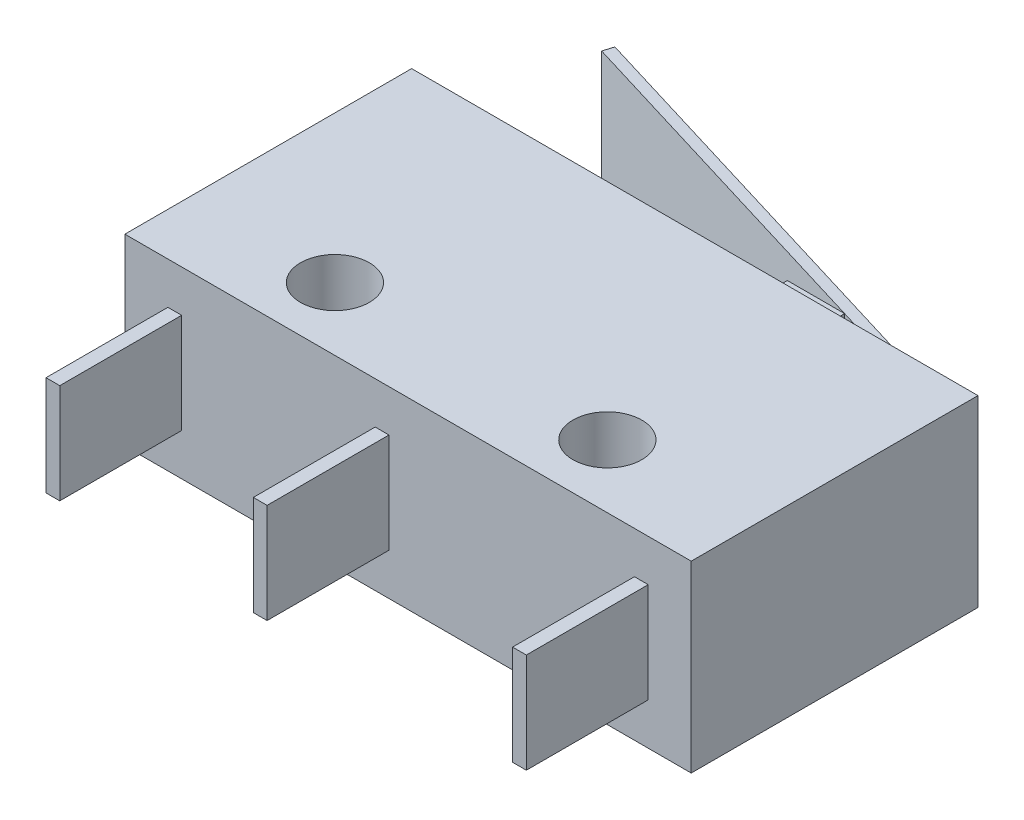
ISO-10303-21;
HEADER;
FILE_DESCRIPTION(('STEP AP214'),'2;1');
FILE_NAME('part.step','',(''),(''),'','','');
FILE_SCHEMA(('AUTOMOTIVE_DESIGN { 1 0 10303 214 1 1 1 1 }'));
ENDSEC;
DATA;
#1=APPLICATION_CONTEXT('core data for automotive mechanical design processes');
#2=APPLICATION_PROTOCOL_DEFINITION('international standard','automotive_design',2000,#1);
#3=PRODUCT_CONTEXT('',#1,'mechanical');
#4=PRODUCT('Part','Part','',(#3));
#5=PRODUCT_RELATED_PRODUCT_CATEGORY('part','',(#4));
#6=PRODUCT_DEFINITION_FORMATION('','',#4);
#7=PRODUCT_DEFINITION_CONTEXT('part definition',#1,'design');
#8=PRODUCT_DEFINITION('design','',#6,#7);
#9=PRODUCT_DEFINITION_SHAPE('','',#8);
#10=(LENGTH_UNIT() NAMED_UNIT(*) SI_UNIT(.MILLI.,.METRE.));
#11=(NAMED_UNIT(*) PLANE_ANGLE_UNIT() SI_UNIT($,.RADIAN.));
#12=(NAMED_UNIT(*) SI_UNIT($,.STERADIAN.) SOLID_ANGLE_UNIT());
#13=UNCERTAINTY_MEASURE_WITH_UNIT(LENGTH_MEASURE(1.E-05),#10,'distance_accuracy_value','');
#14=(GEOMETRIC_REPRESENTATION_CONTEXT(3) GLOBAL_UNCERTAINTY_ASSIGNED_CONTEXT((#13)) GLOBAL_UNIT_ASSIGNED_CONTEXT((#10,
#11,#12)) REPRESENTATION_CONTEXT('',''));
#15=CARTESIAN_POINT('',(0.,0.,0.));
#16=DIRECTION('',(0.,0.,1.));
#17=DIRECTION('',(1.,0.,0.));
#18=AXIS2_PLACEMENT_3D('',#15,#16,#17);
#19=CARTESIAN_POINT('',(11.75,1.2,0.));
#20=DIRECTION('',(1.,0.,0.));
#21=DIRECTION('',(0.,0.,-1.));
#22=AXIS2_PLACEMENT_3D('',#19,#20,#21);
#23=PLANE('',#22);
#24=DIRECTION('',(0.,1.,0.));
#25=VECTOR('',#24,1.);
#26=CARTESIAN_POINT('',(11.75,1.2,-10.));
#27=LINE('',#26,#25);
#28=CARTESIAN_POINT('',(11.75,1.2,-10.));
#29=VERTEX_POINT('',#28);
#30=CARTESIAN_POINT('',(11.75,5.2,-10.));
#31=VERTEX_POINT('',#30);
#32=EDGE_CURVE('E120',#29,#31,#27,.T.);
#33=ORIENTED_EDGE('',*,*,#32,.T.);
#34=DIRECTION('',(0.,0.,-1.));
#35=VECTOR('',#34,1.);
#36=CARTESIAN_POINT('',(11.75,5.2,0.));
#37=LINE('',#36,#35);
#38=CARTESIAN_POINT('',(11.75,5.2,-11.35));
#39=VERTEX_POINT('',#38);
#40=EDGE_CURVE('E13',#31,#39,#37,.T.);
#41=ORIENTED_EDGE('',*,*,#40,.T.);
#42=DIRECTION('',(0.,1.,0.));
#43=VECTOR('',#42,1.);
#44=CARTESIAN_POINT('',(11.75,1.2,-11.35));
#45=LINE('',#44,#43);
#46=CARTESIAN_POINT('',(11.75,1.2,-11.35));
#47=VERTEX_POINT('',#46);
#48=EDGE_CURVE('E155',#47,#39,#45,.T.);
#49=ORIENTED_EDGE('',*,*,#48,.F.);
#50=DIRECTION('',(0.,0.,-1.));
#51=VECTOR('',#50,1.);
#52=CARTESIAN_POINT('',(11.75,1.2,0.));
#53=LINE('',#52,#51);
#54=EDGE_CURVE('E158',#29,#47,#53,.T.);
#55=ORIENTED_EDGE('',*,*,#54,.F.);
#56=EDGE_LOOP('',(#33,#41,#49,#55));
#57=FACE_BOUND('',#56,.T.);
#58=ADVANCED_FACE('F105',(#57),#23,.F.);
#59=CARTESIAN_POINT('',(0.,1.2,-11.35));
#60=DIRECTION('',(0.,0.,-1.));
#61=DIRECTION('',(-1.,0.,0.));
#62=AXIS2_PLACEMENT_3D('',#59,#60,#61);
#63=PLANE('',#62);
#64=ORIENTED_EDGE('',*,*,#48,.T.);
#65=DIRECTION('',(-1.,0.,0.));
#66=VECTOR('',#65,1.);
#67=CARTESIAN_POINT('',(0.,5.2,-11.35));
#68=LINE('',#67,#66);
#69=CARTESIAN_POINT('',(13.75,5.2,-11.35));
#70=VERTEX_POINT('',#69);
#71=EDGE_CURVE('E149',#70,#39,#68,.T.);
#72=ORIENTED_EDGE('',*,*,#71,.F.);
#73=DIRECTION('',(0.,1.,0.));
#74=VECTOR('',#73,1.);
#75=CARTESIAN_POINT('',(13.75,1.2,-11.35));
#76=LINE('',#75,#74);
#77=CARTESIAN_POINT('',(13.75,1.2,-11.35));
#78=VERTEX_POINT('',#77);
#79=EDGE_CURVE('E109',#78,#70,#76,.T.);
#80=ORIENTED_EDGE('',*,*,#79,.F.);
#81=DIRECTION('',(-1.,0.,0.));
#82=VECTOR('',#81,1.);
#83=CARTESIAN_POINT('',(0.,1.2,-11.35));
#84=LINE('',#83,#82);
#85=EDGE_CURVE('E171',#78,#47,#84,.T.);
#86=ORIENTED_EDGE('',*,*,#85,.T.);
#87=EDGE_LOOP('',(#64,#72,#80,#86));
#88=FACE_BOUND('',#87,.T.);
#89=ADVANCED_FACE('F151',(#88),#63,.T.);
#90=CARTESIAN_POINT('',(13.75,1.2,0.));
#91=DIRECTION('',(1.,0.,0.));
#92=DIRECTION('',(0.,0.,-1.));
#93=AXIS2_PLACEMENT_3D('',#90,#91,#92);
#94=PLANE('',#93);
#95=ORIENTED_EDGE('',*,*,#79,.T.);
#96=DIRECTION('',(0.,0.,-1.));
#97=VECTOR('',#96,1.);
#98=CARTESIAN_POINT('',(13.75,5.2,0.));
#99=LINE('',#98,#97);
#100=CARTESIAN_POINT('',(13.75,5.2,-10.));
#101=VERTEX_POINT('',#100);
#102=EDGE_CURVE('E157',#101,#70,#99,.T.);
#103=ORIENTED_EDGE('',*,*,#102,.F.);
#104=DIRECTION('',(0.,1.,0.));
#105=VECTOR('',#104,1.);
#106=CARTESIAN_POINT('',(13.75,1.2,-10.));
#107=LINE('',#106,#105);
#108=CARTESIAN_POINT('',(13.75,1.2,-10.));
#109=VERTEX_POINT('',#108);
#110=EDGE_CURVE('E128',#109,#101,#107,.T.);
#111=ORIENTED_EDGE('',*,*,#110,.F.);
#112=DIRECTION('',(0.,0.,-1.));
#113=VECTOR('',#112,1.);
#114=CARTESIAN_POINT('',(13.75,1.2,0.));
#115=LINE('',#114,#113);
#116=EDGE_CURVE('E166',#109,#78,#115,.T.);
#117=ORIENTED_EDGE('',*,*,#116,.T.);
#118=EDGE_LOOP('',(#95,#103,#111,#117));
#119=FACE_BOUND('',#118,.T.);
#120=ADVANCED_FACE('F164',(#119),#94,.T.);
#121=CARTESIAN_POINT('',(0.,1.2,-10.));
#122=DIRECTION('',(0.,0.,-1.));
#123=DIRECTION('',(-1.,0.,0.));
#124=AXIS2_PLACEMENT_3D('',#121,#122,#123);
#125=PLANE('',#124);
#126=ORIENTED_EDGE('',*,*,#110,.T.);
#127=DIRECTION('',(-1.,0.,0.));
#128=VECTOR('',#127,1.);
#129=CARTESIAN_POINT('',(0.,5.2,-10.));
#130=LINE('',#129,#128);
#131=EDGE_CURVE('E114',#101,#31,#130,.T.);
#132=ORIENTED_EDGE('',*,*,#131,.T.);
#133=ORIENTED_EDGE('',*,*,#32,.F.);
#134=DIRECTION('',(-1.,0.,0.));
#135=VECTOR('',#134,1.);
#136=CARTESIAN_POINT('',(0.,1.2,-10.));
#137=LINE('',#136,#135);
#138=EDGE_CURVE('E174',#109,#29,#137,.T.);
#139=ORIENTED_EDGE('',*,*,#138,.F.);
#140=EDGE_LOOP('',(#126,#132,#133,#139));
#141=FACE_BOUND('',#140,.T.);
#142=ADVANCED_FACE('F177',(#141),#125,.F.);
#143=CARTESIAN_POINT('',(0.,1.2,0.));
#144=DIRECTION('',(0.,1.,0.));
#145=DIRECTION('',(0.,0.,1.));
#146=AXIS2_PLACEMENT_3D('',#143,#144,#145);
#147=PLANE('',#146);
#148=ORIENTED_EDGE('',*,*,#54,.T.);
#149=ORIENTED_EDGE('',*,*,#85,.F.);
#150=ORIENTED_EDGE('',*,*,#116,.F.);
#151=ORIENTED_EDGE('',*,*,#138,.T.);
#152=EDGE_LOOP('',(#148,#149,#150,#151));
#153=FACE_BOUND('',#152,.T.);
#154=ADVANCED_FACE('F179',(#153),#147,.F.);
#155=CARTESIAN_POINT('',(0.,5.2,0.));
#156=DIRECTION('',(0.,1.,0.));
#157=DIRECTION('',(0.,0.,1.));
#158=AXIS2_PLACEMENT_3D('',#155,#156,#157);
#159=PLANE('',#158);
#160=ORIENTED_EDGE('',*,*,#40,.F.);
#161=ORIENTED_EDGE('',*,*,#131,.F.);
#162=ORIENTED_EDGE('',*,*,#102,.T.);
#163=ORIENTED_EDGE('',*,*,#71,.T.);
#164=EDGE_LOOP('',(#160,#161,#162,#163));
#165=FACE_BOUND('',#164,.T.);
#166=ADVANCED_FACE('F107',(#165),#159,.T.);
#167=CLOSED_SHELL('',(#58,#89,#120,#142,#154,#166));
#168=MANIFOLD_SOLID_BREP('B2',#167);
#169=CARTESIAN_POINT('',(16.63,1.2,-10.4756538182635));
#170=DIRECTION('',(0.290499998572687,0.,-0.956874992268723));
#171=DIRECTION('',(-0.956874992268723,0.,-0.290499998572687));
#172=AXIS2_PLACEMENT_3D('',#169,#170,#171);
#173=PLANE('',#172);
#174=DIRECTION('',(0.,1.,0.));
#175=VECTOR('',#174,1.);
#176=CARTESIAN_POINT('',(1.58251512422854,1.2,-15.0439562300236));
#177=LINE('',#176,#175);
#178=CARTESIAN_POINT('',(1.58251512422854,1.2,-15.0439562300236));
#179=VERTEX_POINT('',#178);
#180=CARTESIAN_POINT('',(1.58251512422854,5.2,-15.0439562300236));
#181=VERTEX_POINT('',#180);
#182=EDGE_CURVE('E245',#179,#181,#177,.T.);
#183=ORIENTED_EDGE('',*,*,#182,.F.);
#184=DIRECTION('',(-0.956874992268723,0.,-0.290499998572687));
#185=VECTOR('',#184,1.);
#186=CARTESIAN_POINT('',(16.63,1.2,-10.4756538182635));
#187=LINE('',#186,#185);
#188=CARTESIAN_POINT('',(16.63,1.2,-10.4756538182635));
#189=VERTEX_POINT('',#188);
#190=EDGE_CURVE('E292',#189,#179,#187,.T.);
#191=ORIENTED_EDGE('',*,*,#190,.F.);
#192=DIRECTION('',(0.,1.,0.));
#193=VECTOR('',#192,1.);
#194=CARTESIAN_POINT('',(16.63,1.2,-10.4756538182635));
#195=LINE('',#194,#193);
#196=CARTESIAN_POINT('',(16.63,5.2,-10.4756538182635));
#197=VERTEX_POINT('',#196);
#198=EDGE_CURVE('E103',#189,#197,#195,.T.);
#199=ORIENTED_EDGE('',*,*,#198,.T.);
#200=DIRECTION('',(-0.956874992268723,0.,-0.290499998572687));
#201=VECTOR('',#200,1.);
#202=CARTESIAN_POINT('',(16.63,5.2,-10.4756538182635));
#203=LINE('',#202,#201);
#204=EDGE_CURVE('E290',#197,#181,#203,.T.);
#205=ORIENTED_EDGE('',*,*,#204,.T.);
#206=EDGE_LOOP('',(#183,#191,#199,#205));
#207=FACE_BOUND('',#206,.T.);
#208=ADVANCED_FACE('F237',(#207),#173,.F.);
#209=CARTESIAN_POINT('',(16.63,1.2,-10.));
#210=DIRECTION('',(1.,0.,0.));
#211=DIRECTION('',(0.,0.,-1.));
#212=AXIS2_PLACEMENT_3D('',#209,#210,#211);
#213=PLANE('',#212);
#214=DIRECTION('',(0.,1.,0.));
#215=VECTOR('',#214,1.);
#216=CARTESIAN_POINT('',(16.63,1.2,-10.));
#217=LINE('',#216,#215);
#218=CARTESIAN_POINT('',(16.63,1.2,-10.));
#219=VERTEX_POINT('',#218);
#220=CARTESIAN_POINT('',(16.63,5.2,-10.));
#221=VERTEX_POINT('',#220);
#222=EDGE_CURVE('E307',#219,#221,#217,.T.);
#223=ORIENTED_EDGE('',*,*,#222,.T.);
#224=DIRECTION('',(0.,0.,-1.));
#225=VECTOR('',#224,1.);
#226=CARTESIAN_POINT('',(16.63,5.2,-10.));
#227=LINE('',#226,#225);
#228=EDGE_CURVE('E301',#221,#197,#227,.T.);
#229=ORIENTED_EDGE('',*,*,#228,.T.);
#230=ORIENTED_EDGE('',*,*,#198,.F.);
#231=DIRECTION('',(0.,0.,-1.));
#232=VECTOR('',#231,1.);
#233=CARTESIAN_POINT('',(16.63,1.2,-10.));
#234=LINE('',#233,#232);
#235=EDGE_CURVE('E319',#219,#189,#234,.T.);
#236=ORIENTED_EDGE('',*,*,#235,.F.);
#237=EDGE_LOOP('',(#223,#229,#230,#236));
#238=FACE_BOUND('',#237,.T.);
#239=ADVANCED_FACE('F239',(#238),#213,.F.);
#240=CARTESIAN_POINT('',(1.58251512422854,1.2,-15.0439562300236));
#241=DIRECTION('',(0.956874992268723,0.,0.290499998572687));
#242=DIRECTION('',(0.290499998572687,0.,-0.956874992268723));
#243=AXIS2_PLACEMENT_3D('',#240,#241,#242);
#244=PLANE('',#243);
#245=ORIENTED_EDGE('',*,*,#182,.T.);
#246=DIRECTION('',(0.290499998572687,0.,-0.956874992268723));
#247=VECTOR('',#246,1.);
#248=CARTESIAN_POINT('',(1.58251512422854,5.2,-15.0439562300236));
#249=LINE('',#248,#247);
#250=CARTESIAN_POINT('',(1.69000012370043,5.2,-15.397999977163));
#251=VERTEX_POINT('',#250);
#252=EDGE_CURVE('E305',#181,#251,#249,.T.);
#253=ORIENTED_EDGE('',*,*,#252,.T.);
#254=DIRECTION('',(0.,1.,0.));
#255=VECTOR('',#254,1.);
#256=CARTESIAN_POINT('',(1.69000012370043,1.2,-15.397999977163));
#257=LINE('',#256,#255);
#258=CARTESIAN_POINT('',(1.69000012370043,1.2,-15.397999977163));
#259=VERTEX_POINT('',#258);
#260=EDGE_CURVE('E333',#259,#251,#257,.T.);
#261=ORIENTED_EDGE('',*,*,#260,.F.);
#262=DIRECTION('',(0.290499998572687,0.,-0.956874992268723));
#263=VECTOR('',#262,1.);
#264=CARTESIAN_POINT('',(1.58251512422854,1.2,-15.0439562300236));
#265=LINE('',#264,#263);
#266=EDGE_CURVE('E322',#179,#259,#265,.T.);
#267=ORIENTED_EDGE('',*,*,#266,.F.);
#268=EDGE_LOOP('',(#245,#253,#261,#267));
#269=FACE_BOUND('',#268,.T.);
#270=ADVANCED_FACE('F336',(#269),#244,.F.);
#271=CARTESIAN_POINT('',(1.69000012370043,1.2,-15.397999977163));
#272=DIRECTION('',(-0.290499998572687,0.,0.956874992268723));
#273=DIRECTION('',(0.956874992268723,0.,0.290499998572687));
#274=AXIS2_PLACEMENT_3D('',#271,#272,#273);
#275=PLANE('',#274);
#276=ORIENTED_EDGE('',*,*,#260,.T.);
#277=DIRECTION('',(0.956874992268723,0.,0.290499998572687));
#278=VECTOR('',#277,1.);
#279=CARTESIAN_POINT('',(1.69000012370043,5.2,-15.397999977163));
#280=LINE('',#279,#278);
#281=CARTESIAN_POINT('',(17.,5.2,-10.75));
#282=VERTEX_POINT('',#281);
#283=EDGE_CURVE('E311',#251,#282,#280,.T.);
#284=ORIENTED_EDGE('',*,*,#283,.T.);
#285=DIRECTION('',(0.,1.,0.));
#286=VECTOR('',#285,1.);
#287=CARTESIAN_POINT('',(17.,1.2,-10.75));
#288=LINE('',#287,#286);
#289=CARTESIAN_POINT('',(17.,1.2,-10.75));
#290=VERTEX_POINT('',#289);
#291=EDGE_CURVE('E331',#290,#282,#288,.T.);
#292=ORIENTED_EDGE('',*,*,#291,.F.);
#293=DIRECTION('',(0.956874992268723,0.,0.290499998572687));
#294=VECTOR('',#293,1.);
#295=CARTESIAN_POINT('',(1.69000012370043,1.2,-15.397999977163));
#296=LINE('',#295,#294);
#297=EDGE_CURVE('E324',#259,#290,#296,.T.);
#298=ORIENTED_EDGE('',*,*,#297,.F.);
#299=EDGE_LOOP('',(#276,#284,#292,#298));
#300=FACE_BOUND('',#299,.T.);
#301=ADVANCED_FACE('F342',(#300),#275,.F.);
#302=CARTESIAN_POINT('',(17.,1.2,-10.75));
#303=DIRECTION('',(-1.,0.,0.));
#304=DIRECTION('',(0.,0.,1.));
#305=AXIS2_PLACEMENT_3D('',#302,#303,#304);
#306=PLANE('',#305);
#307=ORIENTED_EDGE('',*,*,#291,.T.);
#308=DIRECTION('',(0.,0.,1.));
#309=VECTOR('',#308,1.);
#310=CARTESIAN_POINT('',(17.,5.2,-10.75));
#311=LINE('',#310,#309);
#312=CARTESIAN_POINT('',(17.,5.2,-10.));
#313=VERTEX_POINT('',#312);
#314=EDGE_CURVE('E314',#282,#313,#311,.T.);
#315=ORIENTED_EDGE('',*,*,#314,.T.);
#316=DIRECTION('',(0.,1.,0.));
#317=VECTOR('',#316,1.);
#318=CARTESIAN_POINT('',(17.,1.2,-10.));
#319=LINE('',#318,#317);
#320=CARTESIAN_POINT('',(17.,1.2,-10.));
#321=VERTEX_POINT('',#320);
#322=EDGE_CURVE('E329',#321,#313,#319,.T.);
#323=ORIENTED_EDGE('',*,*,#322,.F.);
#324=DIRECTION('',(0.,0.,1.));
#325=VECTOR('',#324,1.);
#326=CARTESIAN_POINT('',(17.,1.2,-10.75));
#327=LINE('',#326,#325);
#328=EDGE_CURVE('E257',#290,#321,#327,.T.);
#329=ORIENTED_EDGE('',*,*,#328,.F.);
#330=EDGE_LOOP('',(#307,#315,#323,#329));
#331=FACE_BOUND('',#330,.T.);
#332=ADVANCED_FACE('F345',(#331),#306,.F.);
#333=CARTESIAN_POINT('',(17.,1.2,-10.));
#334=DIRECTION('',(0.,0.,-1.));
#335=DIRECTION('',(-1.,0.,0.));
#336=AXIS2_PLACEMENT_3D('',#333,#334,#335);
#337=PLANE('',#336);
#338=ORIENTED_EDGE('',*,*,#322,.T.);
#339=DIRECTION('',(-1.,0.,0.));
#340=VECTOR('',#339,1.);
#341=CARTESIAN_POINT('',(17.,5.2,-10.));
#342=LINE('',#341,#340);
#343=EDGE_CURVE('E317',#313,#221,#342,.T.);
#344=ORIENTED_EDGE('',*,*,#343,.T.);
#345=ORIENTED_EDGE('',*,*,#222,.F.);
#346=DIRECTION('',(-1.,0.,0.));
#347=VECTOR('',#346,1.);
#348=CARTESIAN_POINT('',(17.,1.2,-10.));
#349=LINE('',#348,#347);
#350=EDGE_CURVE('E252',#321,#219,#349,.T.);
#351=ORIENTED_EDGE('',*,*,#350,.F.);
#352=EDGE_LOOP('',(#338,#344,#345,#351));
#353=FACE_BOUND('',#352,.T.);
#354=ADVANCED_FACE('F347',(#353),#337,.F.);
#355=CARTESIAN_POINT('',(0.,1.2,0.));
#356=DIRECTION('',(0.,1.,0.));
#357=DIRECTION('',(0.,0.,1.));
#358=AXIS2_PLACEMENT_3D('',#355,#356,#357);
#359=PLANE('',#358);
#360=ORIENTED_EDGE('',*,*,#235,.T.);
#361=ORIENTED_EDGE('',*,*,#190,.T.);
#362=ORIENTED_EDGE('',*,*,#266,.T.);
#363=ORIENTED_EDGE('',*,*,#297,.T.);
#364=ORIENTED_EDGE('',*,*,#328,.T.);
#365=ORIENTED_EDGE('',*,*,#350,.T.);
#366=EDGE_LOOP('',(#360,#361,#362,#363,#364,#365));
#367=FACE_BOUND('',#366,.T.);
#368=ADVANCED_FACE('F339',(#367),#359,.F.);
#369=CARTESIAN_POINT('',(0.,5.2,0.));
#370=DIRECTION('',(0.,1.,0.));
#371=DIRECTION('',(0.,0.,1.));
#372=AXIS2_PLACEMENT_3D('',#369,#370,#371);
#373=PLANE('',#372);
#374=ORIENTED_EDGE('',*,*,#228,.F.);
#375=ORIENTED_EDGE('',*,*,#343,.F.);
#376=ORIENTED_EDGE('',*,*,#314,.F.);
#377=ORIENTED_EDGE('',*,*,#283,.F.);
#378=ORIENTED_EDGE('',*,*,#252,.F.);
#379=ORIENTED_EDGE('',*,*,#204,.F.);
#380=EDGE_LOOP('',(#374,#375,#376,#377,#378,#379));
#381=FACE_BOUND('',#380,.T.);
#382=ADVANCED_FACE('F299',(#381),#373,.T.);
#383=CLOSED_SHELL('',(#208,#239,#270,#301,#332,#354,#368,#382));
#384=MANIFOLD_SOLID_BREP('B7',#383);
#385=CARTESIAN_POINT('',(0.,6.4,0.));
#386=DIRECTION('',(0.,0.,-1.));
#387=DIRECTION('',(-1.,0.,0.));
#388=AXIS2_PLACEMENT_3D('',#385,#386,#387);
#389=PLANE('',#388);
#390=DIRECTION('',(0.,-1.,0.));
#391=VECTOR('',#390,1.);
#392=CARTESIAN_POINT('',(8.73,4.94,0.));
#393=LINE('',#392,#391);
#394=CARTESIAN_POINT('',(8.73,4.94,0.));
#395=VERTEX_POINT('',#394);
#396=CARTESIAN_POINT('',(8.73,1.46,0.));
#397=VERTEX_POINT('',#396);
#398=EDGE_CURVE('E546',#395,#397,#393,.T.);
#399=ORIENTED_EDGE('',*,*,#398,.F.);
#400=DIRECTION('',(-1.,0.,0.));
#401=VECTOR('',#400,1.);
#402=CARTESIAN_POINT('',(8.73,4.94,0.));
#403=LINE('',#402,#401);
#404=CARTESIAN_POINT('',(9.21,4.94,0.));
#405=VERTEX_POINT('',#404);
#406=EDGE_CURVE('E559',#405,#395,#403,.T.);
#407=ORIENTED_EDGE('',*,*,#406,.F.);
#408=DIRECTION('',(0.,1.,0.));
#409=VECTOR('',#408,1.);
#410=CARTESIAN_POINT('',(9.21,4.94,0.));
#411=LINE('',#410,#409);
#412=CARTESIAN_POINT('',(9.21,1.46,0.));
#413=VERTEX_POINT('',#412);
#414=EDGE_CURVE('E568',#413,#405,#411,.T.);
#415=ORIENTED_EDGE('',*,*,#414,.F.);
#416=DIRECTION('',(1.,0.,0.));
#417=VECTOR('',#416,1.);
#418=CARTESIAN_POINT('',(8.73,1.46,0.));
#419=LINE('',#418,#417);
#420=EDGE_CURVE('E549',#397,#413,#419,.T.);
#421=ORIENTED_EDGE('',*,*,#420,.F.);
#422=EDGE_LOOP('',(#399,#407,#415,#421));
#423=FACE_BOUND('',#422,.T.);
#424=DIRECTION('',(1.,0.,0.));
#425=VECTOR('',#424,1.);
#426=CARTESIAN_POINT('',(0.,0.,0.));
#427=LINE('',#426,#425);
#428=CARTESIAN_POINT('',(0.,0.,0.));
#429=VERTEX_POINT('',#428);
#430=CARTESIAN_POINT('',(19.75,0.,0.));
#431=VERTEX_POINT('',#430);
#432=EDGE_CURVE('E643',#429,#431,#427,.T.);
#433=ORIENTED_EDGE('',*,*,#432,.T.);
#434=DIRECTION('',(0.,-1.,0.));
#435=VECTOR('',#434,1.);
#436=CARTESIAN_POINT('',(19.75,6.4,0.));
#437=LINE('',#436,#435);
#438=CARTESIAN_POINT('',(19.75,6.4,0.));
#439=VERTEX_POINT('',#438);
#440=EDGE_CURVE('E420',#439,#431,#437,.T.);
#441=ORIENTED_EDGE('',*,*,#440,.F.);
#442=DIRECTION('',(1.,0.,0.));
#443=VECTOR('',#442,1.);
#444=CARTESIAN_POINT('',(0.,6.4,0.));
#445=LINE('',#444,#443);
#446=CARTESIAN_POINT('',(0.,6.4,0.));
#447=VERTEX_POINT('',#446);
#448=EDGE_CURVE('E633',#447,#439,#445,.T.);
#449=ORIENTED_EDGE('',*,*,#448,.F.);
#450=DIRECTION('',(0.,-1.,0.));
#451=VECTOR('',#450,1.);
#452=CARTESIAN_POINT('',(0.,6.4,0.));
#453=LINE('',#452,#451);
#454=EDGE_CURVE('E235',#447,#429,#453,.T.);
#455=ORIENTED_EDGE('',*,*,#454,.T.);
#456=EDGE_LOOP('',(#433,#441,#449,#455));
#457=FACE_BOUND('',#456,.T.);
#458=DIRECTION('',(0.,-1.,0.));
#459=VECTOR('',#458,1.);
#460=CARTESIAN_POINT('',(1.5,4.94,0.));
#461=LINE('',#460,#459);
#462=CARTESIAN_POINT('',(1.5,4.94,0.));
#463=VERTEX_POINT('',#462);
#464=CARTESIAN_POINT('',(1.5,1.46,0.));
#465=VERTEX_POINT('',#464);
#466=EDGE_CURVE('E584',#463,#465,#461,.T.);
#467=ORIENTED_EDGE('',*,*,#466,.F.);
#468=DIRECTION('',(-1.,0.,0.));
#469=VECTOR('',#468,1.);
#470=CARTESIAN_POINT('',(1.5,4.94,0.));
#471=LINE('',#470,#469);
#472=CARTESIAN_POINT('',(1.98,4.94,0.));
#473=VERTEX_POINT('',#472);
#474=EDGE_CURVE('E589',#473,#463,#471,.T.);
#475=ORIENTED_EDGE('',*,*,#474,.F.);
#476=DIRECTION('',(0.,1.,0.));
#477=VECTOR('',#476,1.);
#478=CARTESIAN_POINT('',(1.98,4.94,0.));
#479=LINE('',#478,#477);
#480=CARTESIAN_POINT('',(1.98,1.46,0.));
#481=VERTEX_POINT('',#480);
#482=EDGE_CURVE('E601',#481,#473,#479,.T.);
#483=ORIENTED_EDGE('',*,*,#482,.F.);
#484=DIRECTION('',(1.,0.,0.));
#485=VECTOR('',#484,1.);
#486=CARTESIAN_POINT('',(1.5,1.46,0.));
#487=LINE('',#486,#485);
#488=EDGE_CURVE('E598',#465,#481,#487,.T.);
#489=ORIENTED_EDGE('',*,*,#488,.F.);
#490=EDGE_LOOP('',(#467,#475,#483,#489));
#491=FACE_BOUND('',#490,.T.);
#492=DIRECTION('',(0.,-1.,0.));
#493=VECTOR('',#492,1.);
#494=CARTESIAN_POINT('',(17.77,4.94,0.));
#495=LINE('',#494,#493);
#496=CARTESIAN_POINT('',(17.77,4.94,0.));
#497=VERTEX_POINT('',#496);
#498=CARTESIAN_POINT('',(17.77,1.46,0.));
#499=VERTEX_POINT('',#498);
#500=EDGE_CURVE('E545',#497,#499,#495,.T.);
#501=ORIENTED_EDGE('',*,*,#500,.F.);
#502=DIRECTION('',(-1.,0.,0.));
#503=VECTOR('',#502,1.);
#504=CARTESIAN_POINT('',(17.77,4.94,0.));
#505=LINE('',#504,#503);
#506=CARTESIAN_POINT('',(18.25,4.94,0.));
#507=VERTEX_POINT('',#506);
#508=EDGE_CURVE('E542',#507,#497,#505,.T.);
#509=ORIENTED_EDGE('',*,*,#508,.F.);
#510=DIRECTION('',(0.,1.,0.));
#511=VECTOR('',#510,1.);
#512=CARTESIAN_POINT('',(18.25,4.94,0.));
#513=LINE('',#512,#511);
#514=CARTESIAN_POINT('',(18.25,1.46,0.));
#515=VERTEX_POINT('',#514);
#516=EDGE_CURVE('E432',#515,#507,#513,.T.);
#517=ORIENTED_EDGE('',*,*,#516,.F.);
#518=DIRECTION('',(1.,0.,0.));
#519=VECTOR('',#518,1.);
#520=CARTESIAN_POINT('',(17.77,1.46,0.));
#521=LINE('',#520,#519);
#522=EDGE_CURVE('E427',#499,#515,#521,.T.);
#523=ORIENTED_EDGE('',*,*,#522,.F.);
#524=EDGE_LOOP('',(#501,#509,#517,#523));
#525=FACE_BOUND('',#524,.T.);
#526=ADVANCED_FACE('F412',(#423,#457,#491,#525),#389,.F.);
#527=CARTESIAN_POINT('',(0.,6.4,0.));
#528=DIRECTION('',(0.,-1.,0.));
#529=DIRECTION('',(0.,0.,-1.));
#530=AXIS2_PLACEMENT_3D('',#527,#528,#529);
#531=PLANE('',#530);
#532=DIRECTION('',(0.,0.,1.));
#533=VECTOR('',#532,1.);
#534=CARTESIAN_POINT('',(0.,6.4,0.));
#535=LINE('',#534,#533);
#536=CARTESIAN_POINT('',(0.,6.4,-10.));
#537=VERTEX_POINT('',#536);
#538=EDGE_CURVE('E630',#537,#447,#535,.T.);
#539=ORIENTED_EDGE('',*,*,#538,.T.);
#540=ORIENTED_EDGE('',*,*,#448,.T.);
#541=DIRECTION('',(0.,0.,-1.));
#542=VECTOR('',#541,1.);
#543=CARTESIAN_POINT('',(19.75,6.4,0.));
#544=LINE('',#543,#542);
#545=CARTESIAN_POINT('',(19.75,6.4,-10.));
#546=VERTEX_POINT('',#545);
#547=EDGE_CURVE('E636',#439,#546,#544,.T.);
#548=ORIENTED_EDGE('',*,*,#547,.T.);
#549=DIRECTION('',(-1.,0.,0.));
#550=VECTOR('',#549,1.);
#551=CARTESIAN_POINT('',(0.,6.4,-10.));
#552=LINE('',#551,#550);
#553=EDGE_CURVE('E638',#546,#537,#552,.T.);
#554=ORIENTED_EDGE('',*,*,#553,.T.);
#555=EDGE_LOOP('',(#539,#540,#548,#554));
#556=FACE_BOUND('',#555,.T.);
#557=CARTESIAN_POINT('',(5.125,6.4,-2.2));
#558=DIRECTION('',(0.,1.,0.));
#559=DIRECTION('',(0.,0.,1.));
#560=AXIS2_PLACEMENT_3D('',#557,#558,#559);
#561=CIRCLE('',#560,1.2);
#562=CARTESIAN_POINT('',(5.125,6.4,-1.));
#563=VERTEX_POINT('',#562);
#564=EDGE_CURVE('E624',#563,#563,#561,.T.);
#565=ORIENTED_EDGE('',*,*,#564,.F.);
#566=EDGE_LOOP('',(#565));
#567=FACE_BOUND('',#566,.T.);
#568=CARTESIAN_POINT('',(14.625,6.4,-2.2));
#569=DIRECTION('',(0.,1.,0.));
#570=DIRECTION('',(0.,0.,1.));
#571=AXIS2_PLACEMENT_3D('',#568,#569,#570);
#572=CIRCLE('',#571,1.2);
#573=CARTESIAN_POINT('',(14.625,6.4,-1.));
#574=VERTEX_POINT('',#573);
#575=EDGE_CURVE('E618',#574,#574,#572,.T.);
#576=ORIENTED_EDGE('',*,*,#575,.F.);
#577=EDGE_LOOP('',(#576));
#578=FACE_BOUND('',#577,.T.);
#579=ADVANCED_FACE('F673',(#556,#567,#578),#531,.F.);
#580=CARTESIAN_POINT('',(0.,0.,0.));
#581=DIRECTION('',(0.,-1.,0.));
#582=DIRECTION('',(0.,0.,-1.));
#583=AXIS2_PLACEMENT_3D('',#580,#581,#582);
#584=PLANE('',#583);
#585=CARTESIAN_POINT('',(5.125,0.,-2.2));
#586=DIRECTION('',(0.,1.,0.));
#587=DIRECTION('',(0.,0.,1.));
#588=AXIS2_PLACEMENT_3D('',#585,#586,#587);
#589=CIRCLE('',#588,1.2);
#590=CARTESIAN_POINT('',(5.125,0.,-1.));
#591=VERTEX_POINT('',#590);
#592=EDGE_CURVE('E621',#591,#591,#589,.T.);
#593=ORIENTED_EDGE('',*,*,#592,.T.);
#594=EDGE_LOOP('',(#593));
#595=FACE_BOUND('',#594,.T.);
#596=DIRECTION('',(0.,0.,1.));
#597=VECTOR('',#596,1.);
#598=CARTESIAN_POINT('',(0.,0.,0.));
#599=LINE('',#598,#597);
#600=CARTESIAN_POINT('',(0.,0.,-10.));
#601=VERTEX_POINT('',#600);
#602=EDGE_CURVE('E627',#601,#429,#599,.T.);
#603=ORIENTED_EDGE('',*,*,#602,.F.);
#604=DIRECTION('',(-1.,0.,0.));
#605=VECTOR('',#604,1.);
#606=CARTESIAN_POINT('',(0.,0.,-10.));
#607=LINE('',#606,#605);
#608=CARTESIAN_POINT('',(19.75,0.,-10.));
#609=VERTEX_POINT('',#608);
#610=EDGE_CURVE('E634',#609,#601,#607,.T.);
#611=ORIENTED_EDGE('',*,*,#610,.F.);
#612=DIRECTION('',(0.,0.,-1.));
#613=VECTOR('',#612,1.);
#614=CARTESIAN_POINT('',(19.75,0.,0.));
#615=LINE('',#614,#613);
#616=EDGE_CURVE('E645',#431,#609,#615,.T.);
#617=ORIENTED_EDGE('',*,*,#616,.F.);
#618=ORIENTED_EDGE('',*,*,#432,.F.);
#619=EDGE_LOOP('',(#603,#611,#617,#618));
#620=FACE_BOUND('',#619,.T.);
#621=CARTESIAN_POINT('',(14.625,0.,-2.2));
#622=DIRECTION('',(0.,1.,0.));
#623=DIRECTION('',(0.,0.,1.));
#624=AXIS2_PLACEMENT_3D('',#621,#622,#623);
#625=CIRCLE('',#624,1.2);
#626=CARTESIAN_POINT('',(14.625,0.,-1.));
#627=VERTEX_POINT('',#626);
#628=EDGE_CURVE('E617',#627,#627,#625,.T.);
#629=ORIENTED_EDGE('',*,*,#628,.T.);
#630=EDGE_LOOP('',(#629));
#631=FACE_BOUND('',#630,.T.);
#632=ADVANCED_FACE('F663',(#595,#620,#631),#584,.T.);
#633=CARTESIAN_POINT('',(0.,6.4,0.));
#634=DIRECTION('',(1.,0.,0.));
#635=DIRECTION('',(0.,0.,-1.));
#636=AXIS2_PLACEMENT_3D('',#633,#634,#635);
#637=PLANE('',#636);
#638=ORIENTED_EDGE('',*,*,#602,.T.);
#639=ORIENTED_EDGE('',*,*,#454,.F.);
#640=ORIENTED_EDGE('',*,*,#538,.F.);
#641=DIRECTION('',(0.,-1.,0.));
#642=VECTOR('',#641,1.);
#643=CARTESIAN_POINT('',(0.,6.4,-10.));
#644=LINE('',#643,#642);
#645=EDGE_CURVE('E640',#537,#601,#644,.T.);
#646=ORIENTED_EDGE('',*,*,#645,.T.);
#647=EDGE_LOOP('',(#638,#639,#640,#646));
#648=FACE_BOUND('',#647,.T.);
#649=ADVANCED_FACE('F414',(#648),#637,.F.);
#650=CARTESIAN_POINT('',(19.75,6.4,0.));
#651=DIRECTION('',(-1.,0.,0.));
#652=DIRECTION('',(0.,0.,1.));
#653=AXIS2_PLACEMENT_3D('',#650,#651,#652);
#654=PLANE('',#653);
#655=ORIENTED_EDGE('',*,*,#616,.T.);
#656=DIRECTION('',(0.,-1.,0.));
#657=VECTOR('',#656,1.);
#658=CARTESIAN_POINT('',(19.75,6.4,-10.));
#659=LINE('',#658,#657);
#660=EDGE_CURVE('E650',#546,#609,#659,.T.);
#661=ORIENTED_EDGE('',*,*,#660,.F.);
#662=ORIENTED_EDGE('',*,*,#547,.F.);
#663=ORIENTED_EDGE('',*,*,#440,.T.);
#664=EDGE_LOOP('',(#655,#661,#662,#663));
#665=FACE_BOUND('',#664,.T.);
#666=ADVANCED_FACE('F657',(#665),#654,.F.);
#667=CARTESIAN_POINT('',(0.,6.4,-10.));
#668=DIRECTION('',(0.,0.,1.));
#669=DIRECTION('',(1.,0.,0.));
#670=AXIS2_PLACEMENT_3D('',#667,#668,#669);
#671=PLANE('',#670);
#672=ORIENTED_EDGE('',*,*,#610,.T.);
#673=ORIENTED_EDGE('',*,*,#645,.F.);
#674=ORIENTED_EDGE('',*,*,#553,.F.);
#675=ORIENTED_EDGE('',*,*,#660,.T.);
#676=EDGE_LOOP('',(#672,#673,#674,#675));
#677=FACE_BOUND('',#676,.T.);
#678=ADVANCED_FACE('F667',(#677),#671,.F.);
#679=CARTESIAN_POINT('',(5.125,6.4,-2.2));
#680=DIRECTION('',(0.,-1.,0.));
#681=DIRECTION('',(0.,0.,-1.));
#682=AXIS2_PLACEMENT_3D('',#679,#680,#681);
#683=CYLINDRICAL_SURFACE('',#682,1.2);
#684=ORIENTED_EDGE('',*,*,#564,.T.);
#685=EDGE_LOOP('',(#684));
#686=FACE_BOUND('',#685,.T.);
#687=ORIENTED_EDGE('',*,*,#592,.F.);
#688=EDGE_LOOP('',(#687));
#689=FACE_BOUND('',#688,.T.);
#690=ADVANCED_FACE('F748',(#686,#689),#683,.F.);
#691=CARTESIAN_POINT('',(14.625,6.4,-2.2));
#692=DIRECTION('',(0.,-1.,0.));
#693=DIRECTION('',(0.,0.,-1.));
#694=AXIS2_PLACEMENT_3D('',#691,#692,#693);
#695=CYLINDRICAL_SURFACE('',#694,1.2);
#696=ORIENTED_EDGE('',*,*,#575,.T.);
#697=EDGE_LOOP('',(#696));
#698=FACE_BOUND('',#697,.T.);
#699=ORIENTED_EDGE('',*,*,#628,.F.);
#700=EDGE_LOOP('',(#699));
#701=FACE_BOUND('',#700,.T.);
#702=ADVANCED_FACE('F744',(#698,#701),#695,.F.);
#703=CARTESIAN_POINT('',(1.5,4.94,4.25));
#704=DIRECTION('',(1.,0.,0.));
#705=DIRECTION('',(0.,1.,0.));
#706=AXIS2_PLACEMENT_3D('',#703,#704,#705);
#707=PLANE('',#706);
#708=ORIENTED_EDGE('',*,*,#466,.T.);
#709=DIRECTION('',(0.,0.,-1.));
#710=VECTOR('',#709,1.);
#711=CARTESIAN_POINT('',(1.5,1.46,4.25));
#712=LINE('',#711,#710);
#713=CARTESIAN_POINT('',(1.5,1.46,4.25));
#714=VERTEX_POINT('',#713);
#715=EDGE_CURVE('E614',#714,#465,#712,.T.);
#716=ORIENTED_EDGE('',*,*,#715,.F.);
#717=DIRECTION('',(0.,-1.,0.));
#718=VECTOR('',#717,1.);
#719=CARTESIAN_POINT('',(1.5,4.94,4.25));
#720=LINE('',#719,#718);
#721=CARTESIAN_POINT('',(1.5,4.94,4.25));
#722=VERTEX_POINT('',#721);
#723=EDGE_CURVE('E585',#722,#714,#720,.T.);
#724=ORIENTED_EDGE('',*,*,#723,.F.);
#725=DIRECTION('',(0.,0.,-1.));
#726=VECTOR('',#725,1.);
#727=CARTESIAN_POINT('',(1.5,4.94,4.25));
#728=LINE('',#727,#726);
#729=EDGE_CURVE('E595',#722,#463,#728,.T.);
#730=ORIENTED_EDGE('',*,*,#729,.T.);
#731=EDGE_LOOP('',(#708,#716,#724,#730));
#732=FACE_BOUND('',#731,.T.);
#733=ADVANCED_FACE('F740',(#732),#707,.F.);
#734=CARTESIAN_POINT('',(1.5,1.46,4.25));
#735=DIRECTION('',(0.,1.,0.));
#736=DIRECTION('',(-1.,0.,0.));
#737=AXIS2_PLACEMENT_3D('',#734,#735,#736);
#738=PLANE('',#737);
#739=ORIENTED_EDGE('',*,*,#488,.T.);
#740=DIRECTION('',(0.,0.,-1.));
#741=VECTOR('',#740,1.);
#742=CARTESIAN_POINT('',(1.98,1.46,4.25));
#743=LINE('',#742,#741);
#744=CARTESIAN_POINT('',(1.98,1.46,4.25));
#745=VERTEX_POINT('',#744);
#746=EDGE_CURVE('E611',#745,#481,#743,.T.);
#747=ORIENTED_EDGE('',*,*,#746,.F.);
#748=DIRECTION('',(1.,0.,0.));
#749=VECTOR('',#748,1.);
#750=CARTESIAN_POINT('',(1.5,1.46,4.25));
#751=LINE('',#750,#749);
#752=EDGE_CURVE('E588',#714,#745,#751,.T.);
#753=ORIENTED_EDGE('',*,*,#752,.F.);
#754=ORIENTED_EDGE('',*,*,#715,.T.);
#755=EDGE_LOOP('',(#739,#747,#753,#754));
#756=FACE_BOUND('',#755,.T.);
#757=ADVANCED_FACE('F736',(#756),#738,.F.);
#758=CARTESIAN_POINT('',(1.98,4.94,4.25));
#759=DIRECTION('',(-1.,0.,0.));
#760=DIRECTION('',(0.,0.,1.));
#761=AXIS2_PLACEMENT_3D('',#758,#759,#760);
#762=PLANE('',#761);
#763=ORIENTED_EDGE('',*,*,#482,.T.);
#764=DIRECTION('',(0.,0.,-1.));
#765=VECTOR('',#764,1.);
#766=CARTESIAN_POINT('',(1.98,4.94,4.25));
#767=LINE('',#766,#765);
#768=CARTESIAN_POINT('',(1.98,4.94,4.25));
#769=VERTEX_POINT('',#768);
#770=EDGE_CURVE('E608',#769,#473,#767,.T.);
#771=ORIENTED_EDGE('',*,*,#770,.F.);
#772=DIRECTION('',(0.,1.,0.));
#773=VECTOR('',#772,1.);
#774=CARTESIAN_POINT('',(1.98,4.94,4.25));
#775=LINE('',#774,#773);
#776=EDGE_CURVE('E591',#745,#769,#775,.T.);
#777=ORIENTED_EDGE('',*,*,#776,.F.);
#778=ORIENTED_EDGE('',*,*,#746,.T.);
#779=EDGE_LOOP('',(#763,#771,#777,#778));
#780=FACE_BOUND('',#779,.T.);
#781=ADVANCED_FACE('F732',(#780),#762,.F.);
#782=CARTESIAN_POINT('',(1.5,4.94,4.25));
#783=DIRECTION('',(0.,-1.,0.));
#784=DIRECTION('',(0.,0.,-1.));
#785=AXIS2_PLACEMENT_3D('',#782,#783,#784);
#786=PLANE('',#785);
#787=ORIENTED_EDGE('',*,*,#474,.T.);
#788=ORIENTED_EDGE('',*,*,#729,.F.);
#789=DIRECTION('',(-1.,0.,0.));
#790=VECTOR('',#789,1.);
#791=CARTESIAN_POINT('',(1.5,4.94,4.25));
#792=LINE('',#791,#790);
#793=EDGE_CURVE('E593',#769,#722,#792,.T.);
#794=ORIENTED_EDGE('',*,*,#793,.F.);
#795=ORIENTED_EDGE('',*,*,#770,.T.);
#796=EDGE_LOOP('',(#787,#788,#794,#795));
#797=FACE_BOUND('',#796,.T.);
#798=ADVANCED_FACE('F728',(#797),#786,.F.);
#799=CARTESIAN_POINT('',(0.,0.,4.25));
#800=DIRECTION('',(0.,0.,1.));
#801=DIRECTION('',(1.,0.,0.));
#802=AXIS2_PLACEMENT_3D('',#799,#800,#801);
#803=PLANE('',#802);
#804=ORIENTED_EDGE('',*,*,#723,.T.);
#805=ORIENTED_EDGE('',*,*,#752,.T.);
#806=ORIENTED_EDGE('',*,*,#776,.T.);
#807=ORIENTED_EDGE('',*,*,#793,.T.);
#808=EDGE_LOOP('',(#804,#805,#806,#807));
#809=FACE_BOUND('',#808,.T.);
#810=ADVANCED_FACE('F724',(#809),#803,.T.);
#811=CARTESIAN_POINT('',(8.73,4.94,4.25));
#812=DIRECTION('',(1.,0.,0.));
#813=DIRECTION('',(0.,0.,-1.));
#814=AXIS2_PLACEMENT_3D('',#811,#812,#813);
#815=PLANE('',#814);
#816=ORIENTED_EDGE('',*,*,#398,.T.);
#817=DIRECTION('',(0.,0.,-1.));
#818=VECTOR('',#817,1.);
#819=CARTESIAN_POINT('',(8.73,1.46,4.25));
#820=LINE('',#819,#818);
#821=CARTESIAN_POINT('',(8.73,1.46,4.25));
#822=VERTEX_POINT('',#821);
#823=EDGE_CURVE('E581',#822,#397,#820,.T.);
#824=ORIENTED_EDGE('',*,*,#823,.F.);
#825=DIRECTION('',(0.,-1.,0.));
#826=VECTOR('',#825,1.);
#827=CARTESIAN_POINT('',(8.73,4.94,4.25));
#828=LINE('',#827,#826);
#829=CARTESIAN_POINT('',(8.73,4.94,4.25));
#830=VERTEX_POINT('',#829);
#831=EDGE_CURVE('E555',#830,#822,#828,.T.);
#832=ORIENTED_EDGE('',*,*,#831,.F.);
#833=DIRECTION('',(0.,0.,-1.));
#834=VECTOR('',#833,1.);
#835=CARTESIAN_POINT('',(8.73,4.94,4.25));
#836=LINE('',#835,#834);
#837=EDGE_CURVE('E564',#830,#395,#836,.T.);
#838=ORIENTED_EDGE('',*,*,#837,.T.);
#839=EDGE_LOOP('',(#816,#824,#832,#838));
#840=FACE_BOUND('',#839,.T.);
#841=ADVANCED_FACE('F720',(#840),#815,.F.);
#842=CARTESIAN_POINT('',(8.73,1.46,4.25));
#843=DIRECTION('',(0.,1.,0.));
#844=DIRECTION('',(0.,0.,1.));
#845=AXIS2_PLACEMENT_3D('',#842,#843,#844);
#846=PLANE('',#845);
#847=ORIENTED_EDGE('',*,*,#420,.T.);
#848=DIRECTION('',(0.,0.,-1.));
#849=VECTOR('',#848,1.);
#850=CARTESIAN_POINT('',(9.21,1.46,4.25));
#851=LINE('',#850,#849);
#852=CARTESIAN_POINT('',(9.21,1.46,4.25));
#853=VERTEX_POINT('',#852);
#854=EDGE_CURVE('E578',#853,#413,#851,.T.);
#855=ORIENTED_EDGE('',*,*,#854,.F.);
#856=DIRECTION('',(1.,0.,0.));
#857=VECTOR('',#856,1.);
#858=CARTESIAN_POINT('',(8.73,1.46,4.25));
#859=LINE('',#858,#857);
#860=EDGE_CURVE('E558',#822,#853,#859,.T.);
#861=ORIENTED_EDGE('',*,*,#860,.F.);
#862=ORIENTED_EDGE('',*,*,#823,.T.);
#863=EDGE_LOOP('',(#847,#855,#861,#862));
#864=FACE_BOUND('',#863,.T.);
#865=ADVANCED_FACE('F716',(#864),#846,.F.);
#866=CARTESIAN_POINT('',(9.21,4.94,4.25));
#867=DIRECTION('',(-1.,0.,0.));
#868=DIRECTION('',(0.,0.,1.));
#869=AXIS2_PLACEMENT_3D('',#866,#867,#868);
#870=PLANE('',#869);
#871=ORIENTED_EDGE('',*,*,#414,.T.);
#872=DIRECTION('',(0.,0.,-1.));
#873=VECTOR('',#872,1.);
#874=CARTESIAN_POINT('',(9.21,4.94,4.25));
#875=LINE('',#874,#873);
#876=CARTESIAN_POINT('',(9.21,4.94,4.25));
#877=VERTEX_POINT('',#876);
#878=EDGE_CURVE('E575',#877,#405,#875,.T.);
#879=ORIENTED_EDGE('',*,*,#878,.F.);
#880=DIRECTION('',(0.,1.,0.));
#881=VECTOR('',#880,1.);
#882=CARTESIAN_POINT('',(9.21,4.94,4.25));
#883=LINE('',#882,#881);
#884=EDGE_CURVE('E561',#853,#877,#883,.T.);
#885=ORIENTED_EDGE('',*,*,#884,.F.);
#886=ORIENTED_EDGE('',*,*,#854,.T.);
#887=EDGE_LOOP('',(#871,#879,#885,#886));
#888=FACE_BOUND('',#887,.T.);
#889=ADVANCED_FACE('F712',(#888),#870,.F.);
#890=CARTESIAN_POINT('',(8.73,4.94,4.25));
#891=DIRECTION('',(0.,-1.,0.));
#892=DIRECTION('',(0.,0.,-1.));
#893=AXIS2_PLACEMENT_3D('',#890,#891,#892);
#894=PLANE('',#893);
#895=ORIENTED_EDGE('',*,*,#406,.T.);
#896=ORIENTED_EDGE('',*,*,#837,.F.);
#897=DIRECTION('',(-1.,0.,0.));
#898=VECTOR('',#897,1.);
#899=CARTESIAN_POINT('',(8.73,4.94,4.25));
#900=LINE('',#899,#898);
#901=EDGE_CURVE('E563',#877,#830,#900,.T.);
#902=ORIENTED_EDGE('',*,*,#901,.F.);
#903=ORIENTED_EDGE('',*,*,#878,.T.);
#904=EDGE_LOOP('',(#895,#896,#902,#903));
#905=FACE_BOUND('',#904,.T.);
#906=ADVANCED_FACE('F708',(#905),#894,.F.);
#907=CARTESIAN_POINT('',(0.,0.,4.25));
#908=DIRECTION('',(0.,0.,1.));
#909=DIRECTION('',(1.,0.,0.));
#910=AXIS2_PLACEMENT_3D('',#907,#908,#909);
#911=PLANE('',#910);
#912=ORIENTED_EDGE('',*,*,#831,.T.);
#913=ORIENTED_EDGE('',*,*,#860,.T.);
#914=ORIENTED_EDGE('',*,*,#884,.T.);
#915=ORIENTED_EDGE('',*,*,#901,.T.);
#916=EDGE_LOOP('',(#912,#913,#914,#915));
#917=FACE_BOUND('',#916,.T.);
#918=ADVANCED_FACE('F705',(#917),#911,.T.);
#919=CARTESIAN_POINT('',(17.77,4.94,4.25));
#920=DIRECTION('',(1.,0.,0.));
#921=DIRECTION('',(0.,0.,-1.));
#922=AXIS2_PLACEMENT_3D('',#919,#920,#921);
#923=PLANE('',#922);
#924=ORIENTED_EDGE('',*,*,#500,.T.);
#925=DIRECTION('',(0.,0.,-1.));
#926=VECTOR('',#925,1.);
#927=CARTESIAN_POINT('',(17.77,1.46,4.25));
#928=LINE('',#927,#926);
#929=CARTESIAN_POINT('',(17.77,1.46,4.25));
#930=VERTEX_POINT('',#929);
#931=EDGE_CURVE('E526',#930,#499,#928,.T.);
#932=ORIENTED_EDGE('',*,*,#931,.F.);
#933=DIRECTION('',(0.,-1.,0.));
#934=VECTOR('',#933,1.);
#935=CARTESIAN_POINT('',(17.77,4.94,4.25));
#936=LINE('',#935,#934);
#937=CARTESIAN_POINT('',(17.77,4.94,4.25));
#938=VERTEX_POINT('',#937);
#939=EDGE_CURVE('E533',#938,#930,#936,.T.);
#940=ORIENTED_EDGE('',*,*,#939,.F.);
#941=DIRECTION('',(0.,0.,-1.));
#942=VECTOR('',#941,1.);
#943=CARTESIAN_POINT('',(17.77,4.94,4.25));
#944=LINE('',#943,#942);
#945=EDGE_CURVE('E683',#938,#497,#944,.T.);
#946=ORIENTED_EDGE('',*,*,#945,.T.);
#947=EDGE_LOOP('',(#924,#932,#940,#946));
#948=FACE_BOUND('',#947,.T.);
#949=ADVANCED_FACE('F544',(#948),#923,.F.);
#950=CARTESIAN_POINT('',(17.77,1.46,4.25));
#951=DIRECTION('',(0.,1.,0.));
#952=DIRECTION('',(0.,0.,1.));
#953=AXIS2_PLACEMENT_3D('',#950,#951,#952);
#954=PLANE('',#953);
#955=ORIENTED_EDGE('',*,*,#522,.T.);
#956=DIRECTION('',(0.,0.,-1.));
#957=VECTOR('',#956,1.);
#958=CARTESIAN_POINT('',(18.25,1.46,4.25));
#959=LINE('',#958,#957);
#960=CARTESIAN_POINT('',(18.25,1.46,4.25));
#961=VERTEX_POINT('',#960);
#962=EDGE_CURVE('E529',#961,#515,#959,.T.);
#963=ORIENTED_EDGE('',*,*,#962,.F.);
#964=DIRECTION('',(1.,0.,0.));
#965=VECTOR('',#964,1.);
#966=CARTESIAN_POINT('',(17.77,1.46,4.25));
#967=LINE('',#966,#965);
#968=EDGE_CURVE('E522',#930,#961,#967,.T.);
#969=ORIENTED_EDGE('',*,*,#968,.F.);
#970=ORIENTED_EDGE('',*,*,#931,.T.);
#971=EDGE_LOOP('',(#955,#963,#969,#970));
#972=FACE_BOUND('',#971,.T.);
#973=ADVANCED_FACE('F524',(#972),#954,.F.);
#974=CARTESIAN_POINT('',(18.25,4.94,4.25));
#975=DIRECTION('',(-1.,0.,0.));
#976=DIRECTION('',(0.,0.,1.));
#977=AXIS2_PLACEMENT_3D('',#974,#975,#976);
#978=PLANE('',#977);
#979=ORIENTED_EDGE('',*,*,#516,.T.);
#980=DIRECTION('',(0.,0.,-1.));
#981=VECTOR('',#980,1.);
#982=CARTESIAN_POINT('',(18.25,4.94,4.25));
#983=LINE('',#982,#981);
#984=CARTESIAN_POINT('',(18.25,4.94,4.25));
#985=VERTEX_POINT('',#984);
#986=EDGE_CURVE('E551',#985,#507,#983,.T.);
#987=ORIENTED_EDGE('',*,*,#986,.F.);
#988=DIRECTION('',(0.,1.,0.));
#989=VECTOR('',#988,1.);
#990=CARTESIAN_POINT('',(18.25,4.94,4.25));
#991=LINE('',#990,#989);
#992=EDGE_CURVE('E532',#961,#985,#991,.T.);
#993=ORIENTED_EDGE('',*,*,#992,.F.);
#994=ORIENTED_EDGE('',*,*,#962,.T.);
#995=EDGE_LOOP('',(#979,#987,#993,#994));
#996=FACE_BOUND('',#995,.T.);
#997=ADVANCED_FACE('F692',(#996),#978,.F.);
#998=CARTESIAN_POINT('',(17.77,4.94,4.25));
#999=DIRECTION('',(0.,-1.,0.));
#1000=DIRECTION('',(0.,0.,-1.));
#1001=AXIS2_PLACEMENT_3D('',#998,#999,#1000);
#1002=PLANE('',#1001);
#1003=ORIENTED_EDGE('',*,*,#508,.T.);
#1004=ORIENTED_EDGE('',*,*,#945,.F.);
#1005=DIRECTION('',(-1.,0.,0.));
#1006=VECTOR('',#1005,1.);
#1007=CARTESIAN_POINT('',(17.77,4.94,4.25));
#1008=LINE('',#1007,#1006);
#1009=EDGE_CURVE('E538',#985,#938,#1008,.T.);
#1010=ORIENTED_EDGE('',*,*,#1009,.F.);
#1011=ORIENTED_EDGE('',*,*,#986,.T.);
#1012=EDGE_LOOP('',(#1003,#1004,#1010,#1011));
#1013=FACE_BOUND('',#1012,.T.);
#1014=ADVANCED_FACE('F682',(#1013),#1002,.F.);
#1015=CARTESIAN_POINT('',(0.,0.,4.25));
#1016=DIRECTION('',(0.,0.,1.));
#1017=DIRECTION('',(1.,0.,0.));
#1018=AXIS2_PLACEMENT_3D('',#1015,#1016,#1017);
#1019=PLANE('',#1018);
#1020=ORIENTED_EDGE('',*,*,#939,.T.);
#1021=ORIENTED_EDGE('',*,*,#968,.T.);
#1022=ORIENTED_EDGE('',*,*,#992,.T.);
#1023=ORIENTED_EDGE('',*,*,#1009,.T.);
#1024=EDGE_LOOP('',(#1020,#1021,#1022,#1023));
#1025=FACE_BOUND('',#1024,.T.);
#1026=ADVANCED_FACE('F536',(#1025),#1019,.T.);
#1027=CLOSED_SHELL('',(#526,#579,#632,#649,#666,#678,#690,#702,#733,#757,#781,#798,#810,#841,
#865,#889,#906,#918,#949,#973,#997,#1014,#1026));
#1028=MANIFOLD_SOLID_BREP('B97',#1027);
#1029=ADVANCED_BREP_SHAPE_REPRESENTATION('',(#18,#168,#384,#1028),#14);
#1030=SHAPE_DEFINITION_REPRESENTATION(#9,#1029);
ENDSEC;
END-ISO-10303-21;
